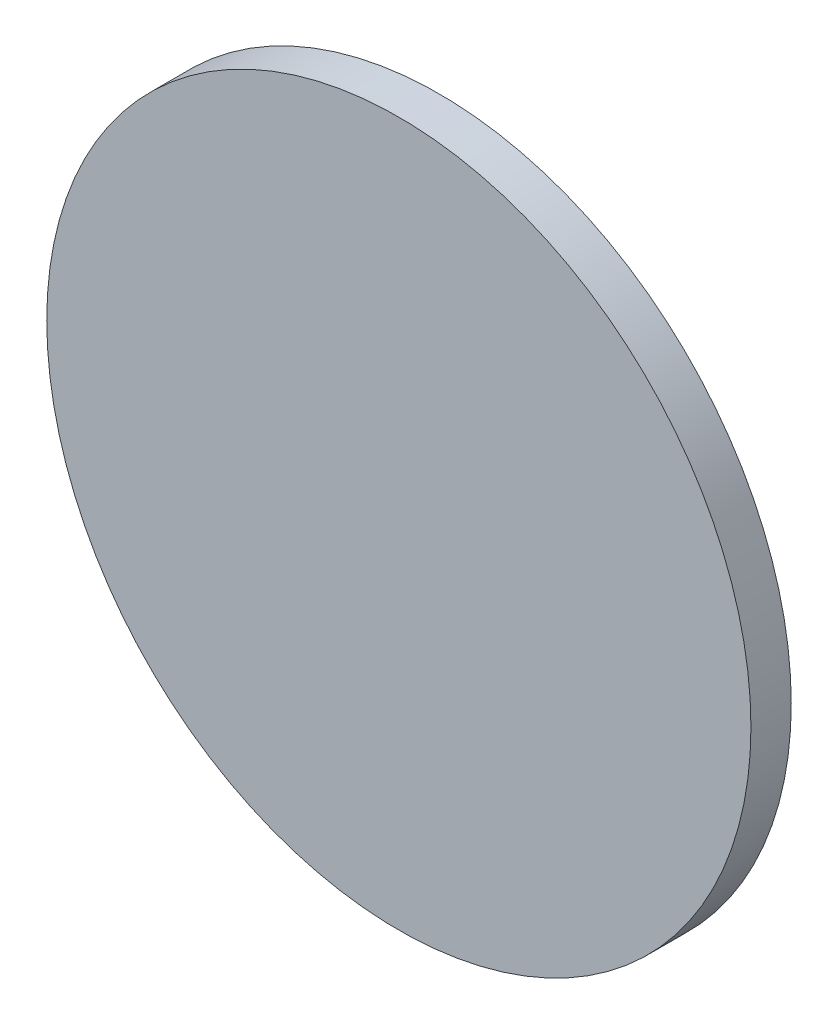
ISO-10303-21;
HEADER;
FILE_DESCRIPTION(('STEP AP214'),'2;1');
FILE_NAME('part.step','',(''),(''),'','','');
FILE_SCHEMA(('AUTOMOTIVE_DESIGN { 1 0 10303 214 1 1 1 1 }'));
ENDSEC;
DATA;
#1=APPLICATION_CONTEXT('core data for automotive mechanical design processes');
#2=APPLICATION_PROTOCOL_DEFINITION('international standard','automotive_design',2000,#1);
#3=PRODUCT_CONTEXT('',#1,'mechanical');
#4=PRODUCT('Part','Part','',(#3));
#5=PRODUCT_RELATED_PRODUCT_CATEGORY('part','',(#4));
#6=PRODUCT_DEFINITION_FORMATION('','',#4);
#7=PRODUCT_DEFINITION_CONTEXT('part definition',#1,'design');
#8=PRODUCT_DEFINITION('design','',#6,#7);
#9=PRODUCT_DEFINITION_SHAPE('','',#8);
#10=(LENGTH_UNIT() NAMED_UNIT(*) SI_UNIT(.MILLI.,.METRE.));
#11=(NAMED_UNIT(*) PLANE_ANGLE_UNIT() SI_UNIT($,.RADIAN.));
#12=(NAMED_UNIT(*) SI_UNIT($,.STERADIAN.) SOLID_ANGLE_UNIT());
#13=UNCERTAINTY_MEASURE_WITH_UNIT(LENGTH_MEASURE(1.E-05),#10,'distance_accuracy_value','');
#14=(GEOMETRIC_REPRESENTATION_CONTEXT(3) GLOBAL_UNCERTAINTY_ASSIGNED_CONTEXT((#13)) GLOBAL_UNIT_ASSIGNED_CONTEXT((#10,
#11,#12)) REPRESENTATION_CONTEXT('',''));
#15=CARTESIAN_POINT('',(0.,0.,0.));
#16=DIRECTION('',(0.,0.,1.));
#17=DIRECTION('',(1.,0.,0.));
#18=AXIS2_PLACEMENT_3D('',#15,#16,#17);
#19=CARTESIAN_POINT('',(0.,0.,3.));
#20=DIRECTION('',(0.,0.,-1.));
#21=DIRECTION('',(-1.,0.,0.));
#22=AXIS2_PLACEMENT_3D('',#19,#20,#21);
#23=CYLINDRICAL_SURFACE('',#22,26.2);
#24=CARTESIAN_POINT('',(0.,0.,3.));
#25=DIRECTION('',(0.,0.,1.));
#26=DIRECTION('',(1.,0.,0.));
#27=AXIS2_PLACEMENT_3D('',#24,#25,#26);
#28=CIRCLE('',#27,26.2);
#29=CARTESIAN_POINT('',(26.2,0.,3.));
#30=VERTEX_POINT('',#29);
#31=EDGE_CURVE('E10',#30,#30,#28,.T.);
#32=ORIENTED_EDGE('',*,*,#31,.F.);
#33=EDGE_LOOP('',(#32));
#34=FACE_BOUND('',#33,.T.);
#35=CARTESIAN_POINT('',(0.,0.,0.));
#36=DIRECTION('',(0.,0.,1.));
#37=DIRECTION('',(1.,0.,0.));
#38=AXIS2_PLACEMENT_3D('',#35,#36,#37);
#39=CIRCLE('',#38,26.2);
#40=CARTESIAN_POINT('',(26.2,0.,0.));
#41=VERTEX_POINT('',#40);
#42=EDGE_CURVE('E44',#41,#41,#39,.T.);
#43=ORIENTED_EDGE('',*,*,#42,.T.);
#44=EDGE_LOOP('',(#43));
#45=FACE_BOUND('',#44,.T.);
#46=ADVANCED_FACE('F41',(#34,#45),#23,.T.);
#47=CARTESIAN_POINT('',(0.,0.,3.));
#48=DIRECTION('',(0.,0.,1.));
#49=DIRECTION('',(1.,0.,0.));
#50=AXIS2_PLACEMENT_3D('',#47,#48,#49);
#51=PLANE('',#50);
#52=ORIENTED_EDGE('',*,*,#31,.T.);
#53=EDGE_LOOP('',(#52));
#54=FACE_BOUND('',#53,.T.);
#55=ADVANCED_FACE('F56',(#54),#51,.T.);
#56=CARTESIAN_POINT('',(0.,0.,0.));
#57=DIRECTION('',(0.,0.,1.));
#58=DIRECTION('',(1.,0.,0.));
#59=AXIS2_PLACEMENT_3D('',#56,#57,#58);
#60=PLANE('',#59);
#61=ORIENTED_EDGE('',*,*,#42,.F.);
#62=EDGE_LOOP('',(#61));
#63=FACE_BOUND('',#62,.T.);
#64=ADVANCED_FACE('F54',(#63),#60,.F.);
#65=CLOSED_SHELL('',(#46,#55,#64));
#66=MANIFOLD_SOLID_BREP('B2',#65);
#67=ADVANCED_BREP_SHAPE_REPRESENTATION('',(#18,#66),#14);
#68=SHAPE_DEFINITION_REPRESENTATION(#9,#67);
ENDSEC;
END-ISO-10303-21;
